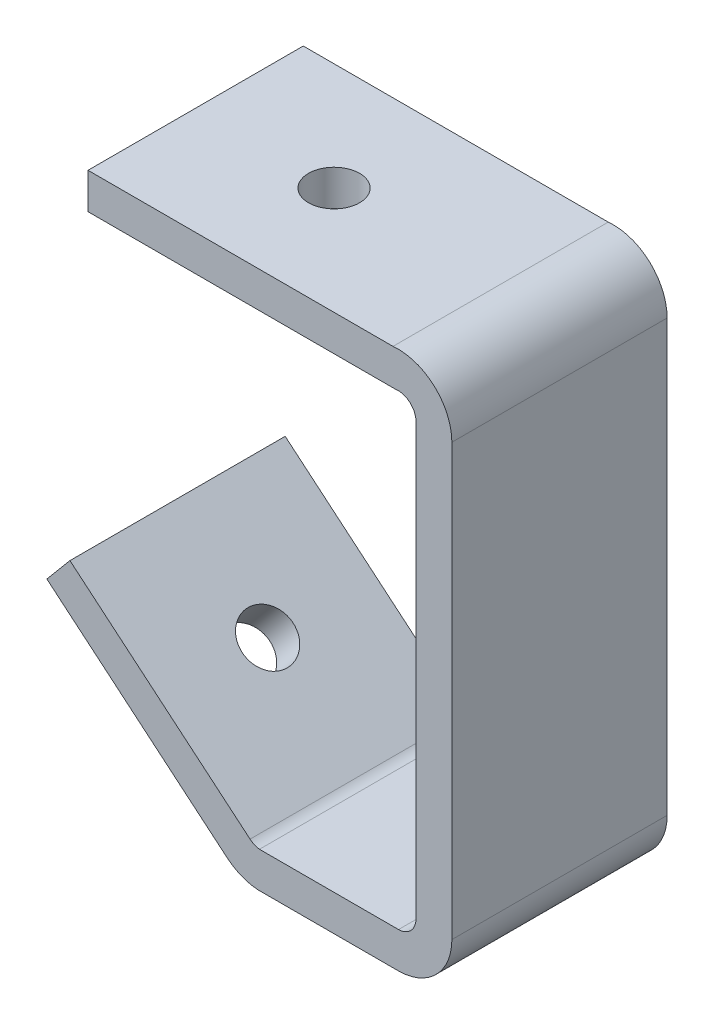
ISO-10303-21;
HEADER;
FILE_DESCRIPTION(('STEP AP214'),'2;1');
FILE_NAME('part.step','',(''),(''),'','','');
FILE_SCHEMA(('AUTOMOTIVE_DESIGN { 1 0 10303 214 1 1 1 1 }'));
ENDSEC;
DATA;
#1=APPLICATION_CONTEXT('core data for automotive mechanical design processes');
#2=APPLICATION_PROTOCOL_DEFINITION('international standard','automotive_design',2000,#1);
#3=PRODUCT_CONTEXT('',#1,'mechanical');
#4=PRODUCT('Part','Part','',(#3));
#5=PRODUCT_RELATED_PRODUCT_CATEGORY('part','',(#4));
#6=PRODUCT_DEFINITION_FORMATION('','',#4);
#7=PRODUCT_DEFINITION_CONTEXT('part definition',#1,'design');
#8=PRODUCT_DEFINITION('design','',#6,#7);
#9=PRODUCT_DEFINITION_SHAPE('','',#8);
#10=(LENGTH_UNIT() NAMED_UNIT(*) SI_UNIT(.MILLI.,.METRE.));
#11=(NAMED_UNIT(*) PLANE_ANGLE_UNIT() SI_UNIT($,.RADIAN.));
#12=(NAMED_UNIT(*) SI_UNIT($,.STERADIAN.) SOLID_ANGLE_UNIT());
#13=UNCERTAINTY_MEASURE_WITH_UNIT(LENGTH_MEASURE(1.E-05),#10,'distance_accuracy_value','');
#14=(GEOMETRIC_REPRESENTATION_CONTEXT(3) GLOBAL_UNCERTAINTY_ASSIGNED_CONTEXT((#13)) GLOBAL_UNIT_ASSIGNED_CONTEXT((#10,
#11,#12)) REPRESENTATION_CONTEXT('',''));
#15=CARTESIAN_POINT('',(0.,0.,0.));
#16=DIRECTION('',(0.,0.,1.));
#17=DIRECTION('',(1.,0.,0.));
#18=AXIS2_PLACEMENT_3D('',#15,#16,#17);
#19=CARTESIAN_POINT('',(0.,0.,38.1));
#20=DIRECTION('',(1.,0.,0.));
#21=DIRECTION('',(0.,0.,-1.));
#22=AXIS2_PLACEMENT_3D('',#19,#20,#21);
#23=PLANE('',#22);
#24=DIRECTION('',(0.,-1.,0.));
#25=VECTOR('',#24,1.);
#26=CARTESIAN_POINT('',(0.,0.,0.));
#27=LINE('',#26,#25);
#28=CARTESIAN_POINT('',(0.,0.,0.));
#29=VERTEX_POINT('',#28);
#30=CARTESIAN_POINT('',(0.,-6.35,0.));
#31=VERTEX_POINT('',#30);
#32=EDGE_CURVE('E177',#29,#31,#27,.T.);
#33=ORIENTED_EDGE('',*,*,#32,.T.);
#34=DIRECTION('',(0.,0.,-1.));
#35=VECTOR('',#34,1.);
#36=CARTESIAN_POINT('',(0.,-6.35,38.1));
#37=LINE('',#36,#35);
#38=CARTESIAN_POINT('',(0.,-6.35,38.1));
#39=VERTEX_POINT('',#38);
#40=EDGE_CURVE('E11',#39,#31,#37,.T.);
#41=ORIENTED_EDGE('',*,*,#40,.F.);
#42=DIRECTION('',(0.,-1.,0.));
#43=VECTOR('',#42,1.);
#44=CARTESIAN_POINT('',(0.,0.,38.1));
#45=LINE('',#44,#43);
#46=CARTESIAN_POINT('',(0.,0.,38.1));
#47=VERTEX_POINT('',#46);
#48=EDGE_CURVE('E208',#47,#39,#45,.T.);
#49=ORIENTED_EDGE('',*,*,#48,.F.);
#50=DIRECTION('',(0.,0.,-1.));
#51=VECTOR('',#50,1.);
#52=CARTESIAN_POINT('',(0.,0.,38.1));
#53=LINE('',#52,#51);
#54=EDGE_CURVE('E173',#47,#29,#53,.T.);
#55=ORIENTED_EDGE('',*,*,#54,.T.);
#56=EDGE_LOOP('',(#33,#41,#49,#55));
#57=FACE_BOUND('',#56,.T.);
#58=ADVANCED_FACE('F33',(#57),#23,.F.);
#59=CARTESIAN_POINT('',(0.,-6.35,38.1));
#60=DIRECTION('',(0.,1.,0.));
#61=DIRECTION('',(0.,0.,1.));
#62=AXIS2_PLACEMENT_3D('',#59,#60,#61);
#63=PLANE('',#62);
#64=CARTESIAN_POINT('',(24.5,-6.35,19.05));
#65=DIRECTION('',(0.,1.,0.));
#66=DIRECTION('',(0.,0.,1.));
#67=AXIS2_PLACEMENT_3D('',#64,#65,#66);
#68=CIRCLE('',#67,4.52);
#69=CARTESIAN_POINT('',(24.5,-6.35,23.57));
#70=VERTEX_POINT('',#69);
#71=EDGE_CURVE('E181',#70,#70,#68,.T.);
#72=ORIENTED_EDGE('',*,*,#71,.T.);
#73=EDGE_LOOP('',(#72));
#74=FACE_BOUND('',#73,.T.);
#75=DIRECTION('',(1.,0.,0.));
#76=VECTOR('',#75,1.);
#77=CARTESIAN_POINT('',(0.,-6.35,0.));
#78=LINE('',#77,#76);
#79=CARTESIAN_POINT('',(54.3575952516479,-6.35,0.));
#80=VERTEX_POINT('',#79);
#81=EDGE_CURVE('E180',#31,#80,#78,.T.);
#82=ORIENTED_EDGE('',*,*,#81,.T.);
#83=DIRECTION('',(0.,0.,-1.));
#84=VECTOR('',#83,1.);
#85=CARTESIAN_POINT('',(54.3575952516479,-6.35,38.1));
#86=LINE('',#85,#84);
#87=CARTESIAN_POINT('',(54.3575952516479,-6.35,38.1));
#88=VERTEX_POINT('',#87);
#89=EDGE_CURVE('E41',#88,#80,#86,.T.);
#90=ORIENTED_EDGE('',*,*,#89,.F.);
#91=DIRECTION('',(1.,0.,0.));
#92=VECTOR('',#91,1.);
#93=CARTESIAN_POINT('',(0.,-6.35,38.1));
#94=LINE('',#93,#92);
#95=EDGE_CURVE('E116',#39,#88,#94,.T.);
#96=ORIENTED_EDGE('',*,*,#95,.F.);
#97=ORIENTED_EDGE('',*,*,#40,.T.);
#98=EDGE_LOOP('',(#82,#90,#96,#97));
#99=FACE_BOUND('',#98,.T.);
#100=ADVANCED_FACE('F308',(#74,#99),#63,.F.);
#101=CARTESIAN_POINT('',(54.8713637428796,-9.48822273546947,38.1));
#102=DIRECTION('',(0.,0.,-1.));
#103=DIRECTION('',(-1.,0.,0.));
#104=AXIS2_PLACEMENT_3D('',#101,#102,#103);
#105=CYLINDRICAL_SURFACE('',#104,3.17999999999999);
#106=CARTESIAN_POINT('',(54.8713637428796,-9.48822273546947,0.));
#107=DIRECTION('',(0.,0.,-1.));
#108=DIRECTION('',(-1.,0.,0.));
#109=AXIS2_PLACEMENT_3D('',#106,#107,#108);
#110=CIRCLE('',#109,3.17999999999999);
#111=CARTESIAN_POINT('',(58.0513637428795,-9.48822273546947,0.));
#112=VERTEX_POINT('',#111);
#113=EDGE_CURVE('E183',#80,#112,#110,.T.);
#114=ORIENTED_EDGE('',*,*,#113,.T.);
#115=DIRECTION('',(0.,0.,-1.));
#116=VECTOR('',#115,1.);
#117=CARTESIAN_POINT('',(58.0513637428795,-9.48822273546947,38.1));
#118=LINE('',#117,#116);
#119=CARTESIAN_POINT('',(58.0513637428795,-9.48822273546947,38.1));
#120=VERTEX_POINT('',#119);
#121=EDGE_CURVE('E239',#120,#112,#118,.T.);
#122=ORIENTED_EDGE('',*,*,#121,.F.);
#123=CARTESIAN_POINT('',(54.8713637428796,-9.48822273546947,38.1));
#124=DIRECTION('',(0.,0.,-1.));
#125=DIRECTION('',(-1.,0.,0.));
#126=AXIS2_PLACEMENT_3D('',#123,#124,#125);
#127=CIRCLE('',#126,3.17999999999999);
#128=EDGE_CURVE('E247',#88,#120,#127,.T.);
#129=ORIENTED_EDGE('',*,*,#128,.F.);
#130=ORIENTED_EDGE('',*,*,#89,.T.);
#131=EDGE_LOOP('',(#114,#122,#129,#130));
#132=FACE_BOUND('',#131,.T.);
#133=ADVANCED_FACE('F245',(#132),#105,.F.);
#134=CARTESIAN_POINT('',(58.0513637428795,-9.48822273546947,38.1));
#135=DIRECTION('',(1.,0.,0.));
#136=DIRECTION('',(0.,1.,0.));
#137=AXIS2_PLACEMENT_3D('',#134,#135,#136);
#138=PLANE('',#137);
#139=DIRECTION('',(0.,-1.,0.));
#140=VECTOR('',#139,1.);
#141=CARTESIAN_POINT('',(58.0513637428795,-9.48822273546947,0.));
#142=LINE('',#141,#140);
#143=CARTESIAN_POINT('',(58.0513637428795,-85.7212405559481,0.));
#144=VERTEX_POINT('',#143);
#145=EDGE_CURVE('E185',#112,#144,#142,.T.);
#146=ORIENTED_EDGE('',*,*,#145,.T.);
#147=DIRECTION('',(0.,0.,-1.));
#148=VECTOR('',#147,1.);
#149=CARTESIAN_POINT('',(58.0513637428795,-85.7212405559481,38.1));
#150=LINE('',#149,#148);
#151=CARTESIAN_POINT('',(58.0513637428795,-85.7212405559481,38.1));
#152=VERTEX_POINT('',#151);
#153=EDGE_CURVE('E236',#152,#144,#150,.T.);
#154=ORIENTED_EDGE('',*,*,#153,.F.);
#155=DIRECTION('',(0.,-1.,0.));
#156=VECTOR('',#155,1.);
#157=CARTESIAN_POINT('',(58.0513637428795,-9.48822273546947,38.1));
#158=LINE('',#157,#156);
#159=EDGE_CURVE('E265',#120,#152,#158,.T.);
#160=ORIENTED_EDGE('',*,*,#159,.F.);
#161=ORIENTED_EDGE('',*,*,#121,.T.);
#162=EDGE_LOOP('',(#146,#154,#160,#161));
#163=FACE_BOUND('',#162,.T.);
#164=ADVANCED_FACE('F256',(#163),#138,.F.);
#165=CARTESIAN_POINT('',(54.8713637428796,-85.7212405559481,38.1));
#166=DIRECTION('',(0.,0.,-1.));
#167=DIRECTION('',(-1.,0.,0.));
#168=AXIS2_PLACEMENT_3D('',#165,#166,#167);
#169=CYLINDRICAL_SURFACE('',#168,3.17999999999998);
#170=CARTESIAN_POINT('',(54.8713637428796,-85.7212405559481,0.));
#171=DIRECTION('',(0.,0.,-1.));
#172=DIRECTION('',(-1.,0.,0.));
#173=AXIS2_PLACEMENT_3D('',#170,#171,#172);
#174=CIRCLE('',#173,3.17999999999998);
#175=CARTESIAN_POINT('',(54.9601803902528,-88.9,0.));
#176=VERTEX_POINT('',#175);
#177=EDGE_CURVE('E187',#144,#176,#174,.T.);
#178=ORIENTED_EDGE('',*,*,#177,.T.);
#179=DIRECTION('',(0.,0.,-1.));
#180=VECTOR('',#179,1.);
#181=CARTESIAN_POINT('',(54.9601803902528,-88.9,38.1));
#182=LINE('',#181,#180);
#183=CARTESIAN_POINT('',(54.9601803902528,-88.9,38.1));
#184=VERTEX_POINT('',#183);
#185=EDGE_CURVE('E233',#184,#176,#182,.T.);
#186=ORIENTED_EDGE('',*,*,#185,.F.);
#187=CARTESIAN_POINT('',(54.8713637428796,-85.7212405559481,38.1));
#188=DIRECTION('',(0.,0.,-1.));
#189=DIRECTION('',(-1.,0.,0.));
#190=AXIS2_PLACEMENT_3D('',#187,#188,#189);
#191=CIRCLE('',#190,3.17999999999998);
#192=EDGE_CURVE('E262',#152,#184,#191,.T.);
#193=ORIENTED_EDGE('',*,*,#192,.F.);
#194=ORIENTED_EDGE('',*,*,#153,.T.);
#195=EDGE_LOOP('',(#178,#186,#193,#194));
#196=FACE_BOUND('',#195,.T.);
#197=ADVANCED_FACE('F260',(#196),#169,.F.);
#198=CARTESIAN_POINT('',(54.9601803902528,-88.9,38.1));
#199=DIRECTION('',(0.,-1.,0.));
#200=DIRECTION('',(0.,0.,-1.));
#201=AXIS2_PLACEMENT_3D('',#198,#199,#200);
#202=PLANE('',#201);
#203=DIRECTION('',(-1.,0.,0.));
#204=VECTOR('',#203,1.);
#205=CARTESIAN_POINT('',(54.9601803902528,-88.9,0.));
#206=LINE('',#205,#204);
#207=CARTESIAN_POINT('',(30.3490624669277,-88.9,0.));
#208=VERTEX_POINT('',#207);
#209=EDGE_CURVE('E189',#176,#208,#206,.T.);
#210=ORIENTED_EDGE('',*,*,#209,.T.);
#211=DIRECTION('',(0.,0.,-1.));
#212=VECTOR('',#211,1.);
#213=CARTESIAN_POINT('',(30.3490624669277,-88.9,38.1));
#214=LINE('',#213,#212);
#215=CARTESIAN_POINT('',(30.3490624669277,-88.9,38.1));
#216=VERTEX_POINT('',#215);
#217=EDGE_CURVE('E230',#216,#208,#214,.T.);
#218=ORIENTED_EDGE('',*,*,#217,.F.);
#219=DIRECTION('',(-1.,0.,0.));
#220=VECTOR('',#219,1.);
#221=CARTESIAN_POINT('',(54.9601803902528,-88.9,38.1));
#222=LINE('',#221,#220);
#223=EDGE_CURVE('E264',#184,#216,#222,.T.);
#224=ORIENTED_EDGE('',*,*,#223,.F.);
#225=ORIENTED_EDGE('',*,*,#185,.T.);
#226=EDGE_LOOP('',(#210,#218,#224,#225));
#227=FACE_BOUND('',#226,.T.);
#228=ADVANCED_FACE('F323',(#227),#202,.F.);
#229=CARTESIAN_POINT('',(30.7278652692855,-85.7426421747091,38.1));
#230=DIRECTION('',(0.,0.,-1.));
#231=DIRECTION('',(-1.,0.,0.));
#232=AXIS2_PLACEMENT_3D('',#229,#230,#231);
#233=CYLINDRICAL_SURFACE('',#232,3.18000000000001);
#234=CARTESIAN_POINT('',(30.7278652692855,-85.7426421747091,0.));
#235=DIRECTION('',(0.,0.,-1.));
#236=DIRECTION('',(-1.,0.,0.));
#237=AXIS2_PLACEMENT_3D('',#234,#235,#236);
#238=CIRCLE('',#237,3.18000000000001);
#239=CARTESIAN_POINT('',(28.6838006704823,-88.1786635038274,0.));
#240=VERTEX_POINT('',#239);
#241=EDGE_CURVE('E191',#208,#240,#238,.T.);
#242=ORIENTED_EDGE('',*,*,#241,.T.);
#243=DIRECTION('',(0.,0.,-1.));
#244=VECTOR('',#243,1.);
#245=CARTESIAN_POINT('',(28.6838006704823,-88.1786635038274,38.1));
#246=LINE('',#245,#244);
#247=CARTESIAN_POINT('',(28.6838006704823,-88.1786635038274,38.1));
#248=VERTEX_POINT('',#247);
#249=EDGE_CURVE('E227',#248,#240,#246,.T.);
#250=ORIENTED_EDGE('',*,*,#249,.F.);
#251=CARTESIAN_POINT('',(30.7278652692855,-85.7426421747091,38.1));
#252=DIRECTION('',(0.,0.,-1.));
#253=DIRECTION('',(-1.,0.,0.));
#254=AXIS2_PLACEMENT_3D('',#251,#252,#253);
#255=CIRCLE('',#254,3.18000000000001);
#256=EDGE_CURVE('E267',#216,#248,#255,.T.);
#257=ORIENTED_EDGE('',*,*,#256,.F.);
#258=ORIENTED_EDGE('',*,*,#217,.T.);
#259=EDGE_LOOP('',(#242,#250,#257,#258));
#260=FACE_BOUND('',#259,.T.);
#261=ADVANCED_FACE('F326',(#260),#233,.F.);
#262=CARTESIAN_POINT('',(28.6838006704823,-88.1786635038274,38.1));
#263=DIRECTION('',(-0.64278760968654,-0.766044443118977,0.));
#264=DIRECTION('',(0.766044443118977,-0.64278760968654,0.));
#265=AXIS2_PLACEMENT_3D('',#262,#263,#264);
#266=PLANE('',#265);
#267=CARTESIAN_POINT('',(12.7424158091764,-74.8022533462505,19.05));
#268=DIRECTION('',(-0.64278760968654,-0.766044443118977,0.));
#269=DIRECTION('',(0.766044443118977,-0.64278760968654,0.));
#270=AXIS2_PLACEMENT_3D('',#267,#268,#269);
#271=CIRCLE('',#270,4.515);
#272=CARTESIAN_POINT('',(16.2011064698586,-77.7044394039853,19.05));
#273=VERTEX_POINT('',#272);
#274=EDGE_CURVE('E428',#273,#273,#271,.T.);
#275=ORIENTED_EDGE('',*,*,#274,.T.);
#276=EDGE_LOOP('',(#275));
#277=FACE_BOUND('',#276,.T.);
#278=DIRECTION('',(-0.766044443118977,0.64278760968654,0.));
#279=VECTOR('',#278,1.);
#280=CARTESIAN_POINT('',(28.6838006704823,-88.1786635038274,0.));
#281=LINE('',#280,#279);
#282=CARTESIAN_POINT('',(-3.19896905212954,-61.4258431886736,0.));
#283=VERTEX_POINT('',#282);
#284=EDGE_CURVE('E193',#240,#283,#281,.T.);
#285=ORIENTED_EDGE('',*,*,#284,.T.);
#286=DIRECTION('',(0.,0.,-1.));
#287=VECTOR('',#286,1.);
#288=CARTESIAN_POINT('',(-3.19896905212954,-61.4258431886736,38.1));
#289=LINE('',#288,#287);
#290=CARTESIAN_POINT('',(-3.19896905212954,-61.4258431886736,38.1));
#291=VERTEX_POINT('',#290);
#292=EDGE_CURVE('E224',#291,#283,#289,.T.);
#293=ORIENTED_EDGE('',*,*,#292,.F.);
#294=DIRECTION('',(-0.766044443118977,0.64278760968654,0.));
#295=VECTOR('',#294,1.);
#296=CARTESIAN_POINT('',(28.6838006704823,-88.1786635038274,38.1));
#297=LINE('',#296,#295);
#298=EDGE_CURVE('E273',#248,#291,#297,.T.);
#299=ORIENTED_EDGE('',*,*,#298,.F.);
#300=ORIENTED_EDGE('',*,*,#249,.T.);
#301=EDGE_LOOP('',(#285,#293,#299,#300));
#302=FACE_BOUND('',#301,.T.);
#303=ADVANCED_FACE('F330',(#277,#302),#266,.F.);
#304=CARTESIAN_POINT('',(-3.19896905212954,-61.4258431886736,38.1));
#305=DIRECTION('',(0.766044443118977,-0.64278760968654,0.));
#306=DIRECTION('',(0.64278760968654,0.766044443118977,0.));
#307=AXIS2_PLACEMENT_3D('',#304,#305,#306);
#308=PLANE('',#307);
#309=DIRECTION('',(-0.64278760968654,-0.766044443118977,0.));
#310=VECTOR('',#309,1.);
#311=CARTESIAN_POINT('',(-3.19896905212954,-61.4258431886736,0.));
#312=LINE('',#311,#310);
#313=CARTESIAN_POINT('',(-7.28067037363907,-66.2902254024791,0.));
#314=VERTEX_POINT('',#313);
#315=EDGE_CURVE('E195',#283,#314,#312,.T.);
#316=ORIENTED_EDGE('',*,*,#315,.T.);
#317=DIRECTION('',(0.,0.,-1.));
#318=VECTOR('',#317,1.);
#319=CARTESIAN_POINT('',(-7.28067037363907,-66.2902254024791,38.1));
#320=LINE('',#319,#318);
#321=CARTESIAN_POINT('',(-7.28067037363907,-66.2902254024791,38.1));
#322=VERTEX_POINT('',#321);
#323=EDGE_CURVE('E221',#322,#314,#320,.T.);
#324=ORIENTED_EDGE('',*,*,#323,.F.);
#325=DIRECTION('',(-0.64278760968654,-0.766044443118977,0.));
#326=VECTOR('',#325,1.);
#327=CARTESIAN_POINT('',(-3.19896905212954,-61.4258431886736,38.1));
#328=LINE('',#327,#326);
#329=EDGE_CURVE('E275',#291,#322,#328,.T.);
#330=ORIENTED_EDGE('',*,*,#329,.F.);
#331=ORIENTED_EDGE('',*,*,#292,.T.);
#332=EDGE_LOOP('',(#316,#324,#330,#331));
#333=FACE_BOUND('',#332,.T.);
#334=ADVANCED_FACE('F334',(#333),#308,.F.);
#335=CARTESIAN_POINT('',(24.6020993489728,-93.0430457176329,38.1));
#336=DIRECTION('',(0.642787609686541,0.766044443118977,0.));
#337=DIRECTION('',(-0.766044443118977,0.642787609686541,0.));
#338=AXIS2_PLACEMENT_3D('',#335,#336,#337);
#339=PLANE('',#338);
#340=CARTESIAN_POINT('',(8.66071448766684,-79.666635560056,19.05));
#341=DIRECTION('',(-0.642787609686541,-0.766044443118977,0.));
#342=DIRECTION('',(0.766044443118977,-0.642787609686541,0.));
#343=AXIS2_PLACEMENT_3D('',#340,#341,#342);
#344=CIRCLE('',#343,4.515);
#345=CARTESIAN_POINT('',(12.119405148349,-82.5688216177908,19.05));
#346=VERTEX_POINT('',#345);
#347=EDGE_CURVE('E425',#346,#346,#344,.T.);
#348=ORIENTED_EDGE('',*,*,#347,.F.);
#349=EDGE_LOOP('',(#348));
#350=FACE_BOUND('',#349,.T.);
#351=DIRECTION('',(0.766044443118977,-0.642787609686541,0.));
#352=VECTOR('',#351,1.);
#353=CARTESIAN_POINT('',(24.6020993489728,-93.0430457176329,0.));
#354=LINE('',#353,#352);
#355=CARTESIAN_POINT('',(24.6020993489728,-93.0430457176329,0.));
#356=VERTEX_POINT('',#355);
#357=EDGE_CURVE('E197',#314,#356,#354,.T.);
#358=ORIENTED_EDGE('',*,*,#357,.T.);
#359=DIRECTION('',(0.,0.,-1.));
#360=VECTOR('',#359,1.);
#361=CARTESIAN_POINT('',(24.6020993489728,-93.0430457176329,38.1));
#362=LINE('',#361,#360);
#363=CARTESIAN_POINT('',(24.6020993489728,-93.0430457176329,38.1));
#364=VERTEX_POINT('',#363);
#365=EDGE_CURVE('E218',#364,#356,#362,.T.);
#366=ORIENTED_EDGE('',*,*,#365,.F.);
#367=DIRECTION('',(0.766044443118977,-0.642787609686541,0.));
#368=VECTOR('',#367,1.);
#369=CARTESIAN_POINT('',(24.6020993489728,-93.0430457176329,38.1));
#370=LINE('',#369,#368);
#371=EDGE_CURVE('E277',#322,#364,#370,.T.);
#372=ORIENTED_EDGE('',*,*,#371,.F.);
#373=ORIENTED_EDGE('',*,*,#323,.T.);
#374=EDGE_LOOP('',(#358,#366,#372,#373));
#375=FACE_BOUND('',#374,.T.);
#376=ADVANCED_FACE('F338',(#350,#375),#339,.F.);
#377=CARTESIAN_POINT('',(30.7278652692855,-85.7426421747091,38.1));
#378=DIRECTION('',(0.,0.,-1.));
#379=DIRECTION('',(-1.,0.,0.));
#380=AXIS2_PLACEMENT_3D('',#377,#378,#379);
#381=CYLINDRICAL_SURFACE('',#380,9.53000000000001);
#382=CARTESIAN_POINT('',(30.7278652692855,-85.7426421747091,0.));
#383=DIRECTION('',(0.,0.,1.));
#384=DIRECTION('',(-1.,0.,0.));
#385=AXIS2_PLACEMENT_3D('',#382,#383,#384);
#386=CIRCLE('',#385,9.53000000000001);
#387=CARTESIAN_POINT('',(30.0713234336961,-95.25,0.));
#388=VERTEX_POINT('',#387);
#389=EDGE_CURVE('E199',#356,#388,#386,.T.);
#390=ORIENTED_EDGE('',*,*,#389,.T.);
#391=DIRECTION('',(0.,0.,-1.));
#392=VECTOR('',#391,1.);
#393=CARTESIAN_POINT('',(30.0713234336961,-95.25,38.1));
#394=LINE('',#393,#392);
#395=CARTESIAN_POINT('',(30.0713234336961,-95.25,38.1));
#396=VERTEX_POINT('',#395);
#397=EDGE_CURVE('E215',#396,#388,#394,.T.);
#398=ORIENTED_EDGE('',*,*,#397,.F.);
#399=CARTESIAN_POINT('',(30.7278652692855,-85.7426421747091,38.1));
#400=DIRECTION('',(0.,0.,1.));
#401=DIRECTION('',(-1.,0.,0.));
#402=AXIS2_PLACEMENT_3D('',#399,#400,#401);
#403=CIRCLE('',#402,9.53000000000001);
#404=EDGE_CURVE('E279',#364,#396,#403,.T.);
#405=ORIENTED_EDGE('',*,*,#404,.F.);
#406=ORIENTED_EDGE('',*,*,#365,.T.);
#407=EDGE_LOOP('',(#390,#398,#405,#406));
#408=FACE_BOUND('',#407,.T.);
#409=ADVANCED_FACE('F342',(#408),#381,.T.);
#410=CARTESIAN_POINT('',(55.0251280345445,-95.25,38.1));
#411=DIRECTION('',(0.,1.,0.));
#412=DIRECTION('',(0.,0.,1.));
#413=AXIS2_PLACEMENT_3D('',#410,#411,#412);
#414=PLANE('',#413);
#415=DIRECTION('',(1.,0.,0.));
#416=VECTOR('',#415,1.);
#417=CARTESIAN_POINT('',(55.0251280345445,-95.25,0.));
#418=LINE('',#417,#416);
#419=CARTESIAN_POINT('',(55.0251280345445,-95.25,0.));
#420=VERTEX_POINT('',#419);
#421=EDGE_CURVE('E201',#388,#420,#418,.T.);
#422=ORIENTED_EDGE('',*,*,#421,.T.);
#423=DIRECTION('',(0.,0.,-1.));
#424=VECTOR('',#423,1.);
#425=CARTESIAN_POINT('',(55.0251280345445,-95.25,38.1));
#426=LINE('',#425,#424);
#427=CARTESIAN_POINT('',(55.0251280345445,-95.25,38.1));
#428=VERTEX_POINT('',#427);
#429=EDGE_CURVE('E212',#428,#420,#426,.T.);
#430=ORIENTED_EDGE('',*,*,#429,.F.);
#431=DIRECTION('',(1.,0.,0.));
#432=VECTOR('',#431,1.);
#433=CARTESIAN_POINT('',(55.0251280345445,-95.25,38.1));
#434=LINE('',#433,#432);
#435=EDGE_CURVE('E281',#396,#428,#434,.T.);
#436=ORIENTED_EDGE('',*,*,#435,.F.);
#437=ORIENTED_EDGE('',*,*,#397,.T.);
#438=EDGE_LOOP('',(#422,#430,#436,#437));
#439=FACE_BOUND('',#438,.T.);
#440=ADVANCED_FACE('F287',(#439),#414,.F.);
#441=CARTESIAN_POINT('',(54.8713637428796,-85.7212405559481,38.1));
#442=DIRECTION('',(0.,0.,-1.));
#443=DIRECTION('',(-1.,0.,0.));
#444=AXIS2_PLACEMENT_3D('',#441,#442,#443);
#445=CYLINDRICAL_SURFACE('',#444,9.53);
#446=CARTESIAN_POINT('',(54.8713637428796,-85.7212405559481,0.));
#447=DIRECTION('',(0.,0.,1.));
#448=DIRECTION('',(-1.,0.,0.));
#449=AXIS2_PLACEMENT_3D('',#446,#447,#448);
#450=CIRCLE('',#449,9.53);
#451=CARTESIAN_POINT('',(64.4013637428796,-85.7212405559481,0.));
#452=VERTEX_POINT('',#451);
#453=EDGE_CURVE('E203',#420,#452,#450,.T.);
#454=ORIENTED_EDGE('',*,*,#453,.T.);
#455=DIRECTION('',(0.,0.,-1.));
#456=VECTOR('',#455,1.);
#457=CARTESIAN_POINT('',(64.4013637428796,-85.7212405559481,38.1));
#458=LINE('',#457,#456);
#459=CARTESIAN_POINT('',(64.4013637428796,-85.7212405559481,38.1));
#460=VERTEX_POINT('',#459);
#461=EDGE_CURVE('E168',#460,#452,#458,.T.);
#462=ORIENTED_EDGE('',*,*,#461,.F.);
#463=CARTESIAN_POINT('',(54.8713637428796,-85.7212405559481,38.1));
#464=DIRECTION('',(0.,0.,1.));
#465=DIRECTION('',(-1.,0.,0.));
#466=AXIS2_PLACEMENT_3D('',#463,#464,#465);
#467=CIRCLE('',#466,9.53);
#468=EDGE_CURVE('E159',#428,#460,#467,.T.);
#469=ORIENTED_EDGE('',*,*,#468,.F.);
#470=ORIENTED_EDGE('',*,*,#429,.T.);
#471=EDGE_LOOP('',(#454,#462,#469,#470));
#472=FACE_BOUND('',#471,.T.);
#473=ADVANCED_FACE('F291',(#472),#445,.T.);
#474=CARTESIAN_POINT('',(64.4013637428795,-9.48822273546947,38.1));
#475=DIRECTION('',(-1.,0.,0.));
#476=DIRECTION('',(0.,-1.,0.));
#477=AXIS2_PLACEMENT_3D('',#474,#475,#476);
#478=PLANE('',#477);
#479=DIRECTION('',(0.,1.,0.));
#480=VECTOR('',#479,1.);
#481=CARTESIAN_POINT('',(64.4013637428795,-9.48822273546947,0.));
#482=LINE('',#481,#480);
#483=CARTESIAN_POINT('',(64.4013637428795,-9.48822273546947,0.));
#484=VERTEX_POINT('',#483);
#485=EDGE_CURVE('E167',#452,#484,#482,.T.);
#486=ORIENTED_EDGE('',*,*,#485,.T.);
#487=DIRECTION('',(0.,0.,-1.));
#488=VECTOR('',#487,1.);
#489=CARTESIAN_POINT('',(64.4013637428795,-9.48822273546947,38.1));
#490=LINE('',#489,#488);
#491=CARTESIAN_POINT('',(64.4013637428795,-9.48822273546947,38.1));
#492=VERTEX_POINT('',#491);
#493=EDGE_CURVE('E164',#492,#484,#490,.T.);
#494=ORIENTED_EDGE('',*,*,#493,.F.);
#495=DIRECTION('',(0.,1.,0.));
#496=VECTOR('',#495,1.);
#497=CARTESIAN_POINT('',(64.4013637428795,-9.48822273546947,38.1));
#498=LINE('',#497,#496);
#499=EDGE_CURVE('E153',#460,#492,#498,.T.);
#500=ORIENTED_EDGE('',*,*,#499,.F.);
#501=ORIENTED_EDGE('',*,*,#461,.T.);
#502=EDGE_LOOP('',(#486,#494,#500,#501));
#503=FACE_BOUND('',#502,.T.);
#504=ADVANCED_FACE('F165',(#503),#478,.F.);
#505=CARTESIAN_POINT('',(54.8713637428796,-9.48822273546947,38.1));
#506=DIRECTION('',(0.,0.,-1.));
#507=DIRECTION('',(-1.,0.,0.));
#508=AXIS2_PLACEMENT_3D('',#505,#506,#507);
#509=CYLINDRICAL_SURFACE('',#508,9.52999999999999);
#510=CARTESIAN_POINT('',(54.8713637428796,-9.48822273546947,0.));
#511=DIRECTION('',(0.,0.,1.));
#512=DIRECTION('',(-1.,0.,0.));
#513=AXIS2_PLACEMENT_3D('',#510,#511,#512);
#514=CIRCLE('',#513,9.52999999999999);
#515=CARTESIAN_POINT('',(53.98,0.,0.));
#516=VERTEX_POINT('',#515);
#517=EDGE_CURVE('E102',#484,#516,#514,.T.);
#518=ORIENTED_EDGE('',*,*,#517,.T.);
#519=DIRECTION('',(0.,0.,-1.));
#520=VECTOR('',#519,1.);
#521=CARTESIAN_POINT('',(53.98,0.,38.1));
#522=LINE('',#521,#520);
#523=CARTESIAN_POINT('',(53.98,0.,38.1));
#524=VERTEX_POINT('',#523);
#525=EDGE_CURVE('E169',#524,#516,#522,.T.);
#526=ORIENTED_EDGE('',*,*,#525,.F.);
#527=CARTESIAN_POINT('',(54.8713637428796,-9.48822273546947,38.1));
#528=DIRECTION('',(0.,0.,1.));
#529=DIRECTION('',(-1.,0.,0.));
#530=AXIS2_PLACEMENT_3D('',#527,#528,#529);
#531=CIRCLE('',#530,9.52999999999999);
#532=EDGE_CURVE('E157',#492,#524,#531,.T.);
#533=ORIENTED_EDGE('',*,*,#532,.F.);
#534=ORIENTED_EDGE('',*,*,#493,.T.);
#535=EDGE_LOOP('',(#518,#526,#533,#534));
#536=FACE_BOUND('',#535,.T.);
#537=ADVANCED_FACE('F171',(#536),#509,.T.);
#538=CARTESIAN_POINT('',(0.,0.,38.1));
#539=DIRECTION('',(0.,-1.,0.));
#540=DIRECTION('',(0.,0.,-1.));
#541=AXIS2_PLACEMENT_3D('',#538,#539,#540);
#542=PLANE('',#541);
#543=CARTESIAN_POINT('',(24.5,0.,19.05));
#544=DIRECTION('',(0.,1.,0.));
#545=DIRECTION('',(0.,0.,1.));
#546=AXIS2_PLACEMENT_3D('',#543,#544,#545);
#547=CIRCLE('',#546,4.52);
#548=CARTESIAN_POINT('',(24.5,0.,23.57));
#549=VERTEX_POINT('',#548);
#550=EDGE_CURVE('E429',#549,#549,#547,.T.);
#551=ORIENTED_EDGE('',*,*,#550,.F.);
#552=EDGE_LOOP('',(#551));
#553=FACE_BOUND('',#552,.T.);
#554=DIRECTION('',(-1.,0.,0.));
#555=VECTOR('',#554,1.);
#556=CARTESIAN_POINT('',(0.,0.,0.));
#557=LINE('',#556,#555);
#558=EDGE_CURVE('E108',#516,#29,#557,.T.);
#559=ORIENTED_EDGE('',*,*,#558,.T.);
#560=ORIENTED_EDGE('',*,*,#54,.F.);
#561=DIRECTION('',(-1.,0.,0.));
#562=VECTOR('',#561,1.);
#563=CARTESIAN_POINT('',(0.,0.,38.1));
#564=LINE('',#563,#562);
#565=EDGE_CURVE('E49',#524,#47,#564,.T.);
#566=ORIENTED_EDGE('',*,*,#565,.F.);
#567=ORIENTED_EDGE('',*,*,#525,.T.);
#568=EDGE_LOOP('',(#559,#560,#566,#567));
#569=FACE_BOUND('',#568,.T.);
#570=ADVANCED_FACE('F295',(#553,#569),#542,.F.);
#571=CARTESIAN_POINT('',(54.8713637428796,-9.48822273546947,38.1));
#572=DIRECTION('',(0.,0.,-1.));
#573=DIRECTION('',(-1.,0.,0.));
#574=AXIS2_PLACEMENT_3D('',#571,#572,#573);
#575=PLANE('',#574);
#576=ORIENTED_EDGE('',*,*,#48,.T.);
#577=ORIENTED_EDGE('',*,*,#95,.T.);
#578=ORIENTED_EDGE('',*,*,#128,.T.);
#579=ORIENTED_EDGE('',*,*,#159,.T.);
#580=ORIENTED_EDGE('',*,*,#192,.T.);
#581=ORIENTED_EDGE('',*,*,#223,.T.);
#582=ORIENTED_EDGE('',*,*,#256,.T.);
#583=ORIENTED_EDGE('',*,*,#298,.T.);
#584=ORIENTED_EDGE('',*,*,#329,.T.);
#585=ORIENTED_EDGE('',*,*,#371,.T.);
#586=ORIENTED_EDGE('',*,*,#404,.T.);
#587=ORIENTED_EDGE('',*,*,#435,.T.);
#588=ORIENTED_EDGE('',*,*,#468,.T.);
#589=ORIENTED_EDGE('',*,*,#499,.T.);
#590=ORIENTED_EDGE('',*,*,#532,.T.);
#591=ORIENTED_EDGE('',*,*,#565,.T.);
#592=EDGE_LOOP('',(#576,#577,#578,#579,#580,#581,#582,#583,#584,#585,#586,#587,#588,#589,#590,#591));
#593=FACE_BOUND('',#592,.T.);
#594=ADVANCED_FACE('F155',(#593),#575,.F.);
#595=CARTESIAN_POINT('',(54.8713637428796,-9.48822273546947,0.));
#596=DIRECTION('',(0.,0.,-1.));
#597=DIRECTION('',(-1.,0.,0.));
#598=AXIS2_PLACEMENT_3D('',#595,#596,#597);
#599=PLANE('',#598);
#600=ORIENTED_EDGE('',*,*,#32,.F.);
#601=ORIENTED_EDGE('',*,*,#558,.F.);
#602=ORIENTED_EDGE('',*,*,#517,.F.);
#603=ORIENTED_EDGE('',*,*,#485,.F.);
#604=ORIENTED_EDGE('',*,*,#453,.F.);
#605=ORIENTED_EDGE('',*,*,#421,.F.);
#606=ORIENTED_EDGE('',*,*,#389,.F.);
#607=ORIENTED_EDGE('',*,*,#357,.F.);
#608=ORIENTED_EDGE('',*,*,#315,.F.);
#609=ORIENTED_EDGE('',*,*,#284,.F.);
#610=ORIENTED_EDGE('',*,*,#241,.F.);
#611=ORIENTED_EDGE('',*,*,#209,.F.);
#612=ORIENTED_EDGE('',*,*,#177,.F.);
#613=ORIENTED_EDGE('',*,*,#145,.F.);
#614=ORIENTED_EDGE('',*,*,#113,.F.);
#615=ORIENTED_EDGE('',*,*,#81,.F.);
#616=EDGE_LOOP('',(#600,#601,#602,#603,#604,#605,#606,#607,#608,#609,#610,#611,#612,#613,#614,#615));
#617=FACE_BOUND('',#616,.T.);
#618=ADVANCED_FACE('F251',(#617),#599,.T.);
#619=CARTESIAN_POINT('',(24.5,-38.1,19.05));
#620=DIRECTION('',(0.,1.,0.));
#621=DIRECTION('',(0.,0.,1.));
#622=AXIS2_PLACEMENT_3D('',#619,#620,#621);
#623=CYLINDRICAL_SURFACE('',#622,4.52);
#624=ORIENTED_EDGE('',*,*,#550,.T.);
#625=EDGE_LOOP('',(#624));
#626=FACE_BOUND('',#625,.T.);
#627=ORIENTED_EDGE('',*,*,#71,.F.);
#628=EDGE_LOOP('',(#627));
#629=FACE_BOUND('',#628,.T.);
#630=ADVANCED_FACE('F375',(#626,#629),#623,.F.);
#631=CARTESIAN_POINT('',(15.0885905845323,-72.0061911288663,19.05));
#632=DIRECTION('',(-0.642787609686541,-0.766044443118977,0.));
#633=DIRECTION('',(0.766044443118977,-0.642787609686541,0.));
#634=AXIS2_PLACEMENT_3D('',#631,#632,#633);
#635=CYLINDRICAL_SURFACE('',#634,4.515);
#636=ORIENTED_EDGE('',*,*,#347,.T.);
#637=EDGE_LOOP('',(#636));
#638=FACE_BOUND('',#637,.T.);
#639=ORIENTED_EDGE('',*,*,#274,.F.);
#640=EDGE_LOOP('',(#639));
#641=FACE_BOUND('',#640,.T.);
#642=ADVANCED_FACE('F393',(#638,#641),#635,.F.);
#643=CLOSED_SHELL('',(#58,#100,#133,#164,#197,#228,#261,#303,#334,#376,#409,#440,#473,#504,#537,
#570,#594,#618,#630,#642));
#644=MANIFOLD_SOLID_BREP('B2',#643);
#645=ADVANCED_BREP_SHAPE_REPRESENTATION('',(#18,#644),#14);
#646=SHAPE_DEFINITION_REPRESENTATION(#9,#645);
ENDSEC;
END-ISO-10303-21;
